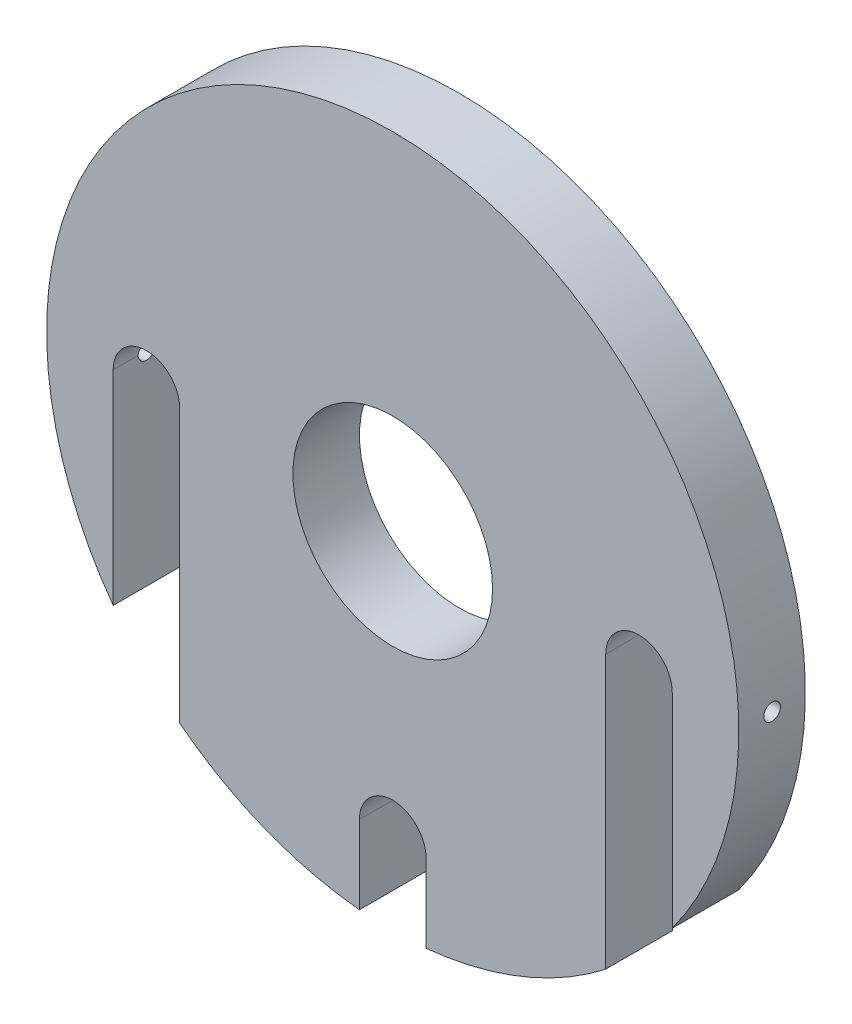
ISO-10303-21;
HEADER;
FILE_DESCRIPTION(('STEP AP214'),'2;1');
FILE_NAME('part.step','',(''),(''),'','','');
FILE_SCHEMA(('AUTOMOTIVE_DESIGN { 1 0 10303 214 1 1 1 1 }'));
ENDSEC;
DATA;
#1=APPLICATION_CONTEXT('core data for automotive mechanical design processes');
#2=APPLICATION_PROTOCOL_DEFINITION('international standard','automotive_design',2000,#1);
#3=PRODUCT_CONTEXT('',#1,'mechanical');
#4=PRODUCT('Part','Part','',(#3));
#5=PRODUCT_RELATED_PRODUCT_CATEGORY('part','',(#4));
#6=PRODUCT_DEFINITION_FORMATION('','',#4);
#7=PRODUCT_DEFINITION_CONTEXT('part definition',#1,'design');
#8=PRODUCT_DEFINITION('design','',#6,#7);
#9=PRODUCT_DEFINITION_SHAPE('','',#8);
#10=(LENGTH_UNIT() NAMED_UNIT(*) SI_UNIT(.MILLI.,.METRE.));
#11=(NAMED_UNIT(*) PLANE_ANGLE_UNIT() SI_UNIT($,.RADIAN.));
#12=(NAMED_UNIT(*) SI_UNIT($,.STERADIAN.) SOLID_ANGLE_UNIT());
#13=UNCERTAINTY_MEASURE_WITH_UNIT(LENGTH_MEASURE(1.E-05),#10,'distance_accuracy_value','');
#14=(GEOMETRIC_REPRESENTATION_CONTEXT(3) GLOBAL_UNCERTAINTY_ASSIGNED_CONTEXT((#13)) GLOBAL_UNIT_ASSIGNED_CONTEXT((#10,
#11,#12)) REPRESENTATION_CONTEXT('',''));
#15=CARTESIAN_POINT('',(0.,0.,0.));
#16=DIRECTION('',(0.,0.,1.));
#17=DIRECTION('',(1.,0.,0.));
#18=AXIS2_PLACEMENT_3D('',#15,#16,#17);
#19=CARTESIAN_POINT('',(0.,0.,10.));
#20=DIRECTION('',(0.,0.,-1.));
#21=DIRECTION('',(-1.,0.,0.));
#22=AXIS2_PLACEMENT_3D('',#19,#20,#21);
#23=CYLINDRICAL_SURFACE('',#22,52.);
#24=CARTESIAN_POINT('',(-52.,0.,6.24999999999998));
#25=CARTESIAN_POINT('',(-51.9999997973088,-0.0702021682379091,6.2499968895859));
#26=CARTESIAN_POINT('',(-51.9998563106322,-0.140454981450219,6.24406613697119));
#27=CARTESIAN_POINT('',(-51.9992977076912,-0.279025062442822,6.22048990731504));
#28=CARTESIAN_POINT('',(-51.9988822660825,-0.347339909542774,6.20283039859609));
#29=CARTESIAN_POINT('',(-51.9978268062926,-0.480006521059341,6.15630034243218));
#30=CARTESIAN_POINT('',(-51.9971868970592,-0.544360190296536,6.12743523302246));
#31=CARTESIAN_POINT('',(-51.99575470482,-0.667290330916391,6.05932103250131));
#32=CARTESIAN_POINT('',(-51.9949624592714,-0.725868217133678,6.02007449314121));
#33=CARTESIAN_POINT('',(-51.9933145118695,-0.835622281287134,5.93229518490517));
#34=CARTESIAN_POINT('',(-51.9924587919931,-0.886796344683112,5.88375977227363));
#35=CARTESIAN_POINT('',(-51.9907805017499,-0.980272477518451,5.77878464423165));
#36=CARTESIAN_POINT('',(-51.9899579326977,-1.02257419539248,5.72234461574973));
#37=CARTESIAN_POINT('',(-51.9884386379106,-1.09710658397418,5.60315653739074));
#38=CARTESIAN_POINT('',(-51.9877419250816,-1.12933622208278,5.54040784161421));
#39=CARTESIAN_POINT('',(-51.9865530394971,-1.18280274961246,5.41038828850494));
#40=CARTESIAN_POINT('',(-51.9860608660679,-1.2040396752478,5.34311744607073));
#41=CARTESIAN_POINT('',(-51.9853366659506,-1.23491404263499,5.20597695611337));
#42=CARTESIAN_POINT('',(-51.9851045888189,-1.24455373360457,5.13610781522614));
#43=CARTESIAN_POINT('',(-51.9849265963996,-1.25196691572491,4.99574265089226));
#44=CARTESIAN_POINT('',(-51.9849806801941,-1.2497404449398,4.92524662945722));
#45=CARTESIAN_POINT('',(-51.985368863679,-1.23348643261604,4.78564409487549));
#46=CARTESIAN_POINT('',(-51.9857029055237,-1.21946132894386,4.71653729770342));
#47=CARTESIAN_POINT('',(-51.9866132562613,-1.1800119384044,4.58165935292268));
#48=CARTESIAN_POINT('',(-51.9871895655884,-1.15458763111172,4.51588821129117));
#49=CARTESIAN_POINT('',(-51.9885195484886,-1.09305874317991,4.38954078401926));
#50=CARTESIAN_POINT('',(-51.9892732406284,-1.05695304442013,4.32896504308654));
#51=CARTESIAN_POINT('',(-51.990873002452,-0.97508713050876,4.21473394256006));
#52=CARTESIAN_POINT('',(-51.9917190722579,-0.929326902589633,4.16107859211825));
#53=CARTESIAN_POINT('',(-51.9934084662207,-0.829437096207218,4.06219713975511));
#54=CARTESIAN_POINT('',(-51.9942517896282,-0.77530540162422,4.01697317549234));
#55=CARTESIAN_POINT('',(-51.9958404123069,-0.660216745710646,3.93625470582223));
#56=CARTESIAN_POINT('',(-51.9965857115635,-0.599259783359249,3.90076020187007));
#57=CARTESIAN_POINT('',(-51.9978942729366,-0.472249784187237,3.84050847217416));
#58=CARTESIAN_POINT('',(-51.9984575339415,-0.406196716252543,3.81575131199297));
#59=CARTESIAN_POINT('',(-51.9993385031685,-0.270870063484839,3.77767840062746));
#60=CARTESIAN_POINT('',(-51.9996562118238,-0.201596484331865,3.76436262926472));
#61=CARTESIAN_POINT('',(-52.0000102059479,-0.0618138289347149,3.7495531009642));
#62=CARTESIAN_POINT('',(-52.000046561819,0.00869493380591818,3.74805638656743));
#63=CARTESIAN_POINT('',(-51.9998339383627,0.148962758512663,3.75691975412827));
#64=CARTESIAN_POINT('',(-51.9995849592427,0.218721821024188,3.76727982745936));
#65=CARTESIAN_POINT('',(-51.9988297750903,0.355501780963677,3.79956023565669));
#66=CARTESIAN_POINT('',(-51.9983235998992,0.422522995077548,3.82147922940406));
#67=CARTESIAN_POINT('',(-51.9971110723133,0.551934463575331,3.8762539091937));
#68=CARTESIAN_POINT('',(-51.9964047196695,0.614324712193831,3.90910960885154));
#69=CARTESIAN_POINT('',(-51.9948712563162,0.732716819717158,3.98483266008584));
#70=CARTESIAN_POINT('',(-51.9940441215981,0.788717404551271,4.02770200316391));
#71=CARTESIAN_POINT('',(-51.9923624047139,0.892727732221843,4.12223250589846));
#72=CARTESIAN_POINT('',(-51.9915078224988,0.940737460803128,4.17389368123867));
#73=CARTESIAN_POINT('',(-51.9898673530022,1.02741309597303,4.28455402755676));
#74=CARTESIAN_POINT('',(-51.9890814797713,1.06607709425557,4.34355469346742));
#75=CARTESIAN_POINT('',(-51.9876672523362,1.13295066954025,4.46721152634058));
#76=CARTESIAN_POINT('',(-51.9870388978446,1.16116026562596,4.53186768297923));
#77=CARTESIAN_POINT('',(-51.9860106523504,1.20632093427851,4.66499293625244));
#78=CARTESIAN_POINT('',(-51.9856107362014,1.22327324608078,4.73346161229381));
#79=CARTESIAN_POINT('',(-51.9850843853326,1.2454421997953,4.87227432871524));
#80=CARTESIAN_POINT('',(-51.9849579506351,1.25065884075391,4.94261836924769));
#81=CARTESIAN_POINT('',(-51.9849928270816,1.24920821155983,5.08316579760952));
#82=CARTESIAN_POINT('',(-51.9851540651841,1.24254395802412,5.1533692166126));
#83=CARTESIAN_POINT('',(-51.9857459567771,1.2175269006696,5.29166052483359));
#84=CARTESIAN_POINT('',(-51.9861766108046,1.19917407354676,5.35974840983338));
#85=CARTESIAN_POINT('',(-51.9872587776231,1.15130109720322,5.49187742806503));
#86=CARTESIAN_POINT('',(-51.9879102943159,1.12178075069791,5.55591848978267));
#87=CARTESIAN_POINT('',(-51.9893607075731,1.05241220497476,5.67813381072752));
#88=CARTESIAN_POINT('',(-51.9901595986442,1.01256439069638,5.73630828850982));
#89=CARTESIAN_POINT('',(-51.9918148783833,0.923664897688957,5.84515186657948));
#90=CARTESIAN_POINT('',(-51.9926712755141,0.874611862405308,5.8958198586795));
#91=CARTESIAN_POINT('',(-51.9943451605303,0.768681394127143,5.98821499771678));
#92=CARTESIAN_POINT('',(-51.9951626387157,0.711802024121723,6.02993992469413));
#93=CARTESIAN_POINT('',(-51.9966667561658,0.591815674581007,6.10326914926611));
#94=CARTESIAN_POINT('',(-51.9973533183665,0.528705059981918,6.13486749323264));
#95=CARTESIAN_POINT('',(-51.998516752348,0.398121934825982,6.18698344501717));
#96=CARTESIAN_POINT('',(-51.9989938745281,0.330654744203557,6.20751429148876));
#97=CARTESIAN_POINT('',(-51.9995568847217,0.218966673448215,6.23146046341417));
#98=CARTESIAN_POINT('',(-51.9997223338094,0.175471022833649,6.23840406759431));
#99=CARTESIAN_POINT('',(-51.9999439549651,0.087990214559126,6.24767481030989));
#100=CARTESIAN_POINT('',(-52.0000001270536,0.0440050569909726,6.25000194971111));
#101=CARTESIAN_POINT('',(-52.,0.,6.24999999999998));
#102=B_SPLINE_CURVE_WITH_KNOTS('',3,(#24,#25,#26,#27,#28,#29,#30,#31,#32,#33,#34,#35,#36,#37,
#38,#39,#40,#41,#42,#43,#44,#45,#46,#47,#48,#49,#50,#51,#52,#53,#54,#55,#56,#57,#58,#59,#60,#61,
#62,#63,#64,#65,#66,#67,#68,#69,#70,#71,#72,#73,#74,#75,#76,#77,#78,#79,#80,#81,#82,#83,#84,#85,
#86,#87,#88,#89,#90,#91,#92,#93,#94,#95,#96,#97,#98,#99,#100,#101),.UNSPECIFIED.,.T.,.F.,(4,2,2,
2,2,2,2,2,2,2,2,2,2,2,2,2,2,2,2,2,2,2,2,2,2,2,2,2,2,2,2,2,2,2,2,2,2,2,4),(0.,0.210445882634705,
0.421143986444405,0.631739966835604,0.842284230842992,1.052888508329,1.2635011294014,
1.47413533559935,1.68476884788204,1.89536150240385,2.1059534813895,2.31650195795665,
2.52705081179168,2.73762171353813,2.94819289375379,3.15881738892334,3.36944191559497,
3.58006772832851,3.79069316959421,4.00126590480604,4.2118384868137,4.42238664260014,
4.63293506050825,4.84352538774352,5.05411609065432,5.26474975785616,5.4753830405633,
5.68599313228496,5.89660324112071,6.10715988263968,6.31771694395633,6.52827772513291,
6.73883065912926,6.94941464628273,7.16005084685117,7.37081065858985,7.58131780231657,
7.71323231476071,7.84514680246531),.UNSPECIFIED.);
#103=CARTESIAN_POINT('',(-52.,0.,6.24999999999998));
#104=VERTEX_POINT('',#103);
#105=EDGE_CURVE('E149',#104,#104,#102,.T.);
#106=ORIENTED_EDGE('',*,*,#105,.T.);
#107=EDGE_LOOP('',(#106));
#108=FACE_BOUND('',#107,.T.);
#109=CARTESIAN_POINT('',(52.,0.,3.75));
#110=CARTESIAN_POINT('',(51.9999997973088,-0.0702021682379091,3.75000311041408));
#111=CARTESIAN_POINT('',(51.9998563106322,-0.140454981450219,3.75593386302879));
#112=CARTESIAN_POINT('',(51.9992977076912,-0.279025062442822,3.77951009268494));
#113=CARTESIAN_POINT('',(51.9988822660825,-0.347339909542774,3.79716960140389));
#114=CARTESIAN_POINT('',(51.9978268062926,-0.480006521059341,3.8436996575678));
#115=CARTESIAN_POINT('',(51.9971868970592,-0.544360190296535,3.87256476697752));
#116=CARTESIAN_POINT('',(51.99575470482,-0.66729033091639,3.94067896749867));
#117=CARTESIAN_POINT('',(51.9949624592714,-0.725868217133678,3.97992550685877));
#118=CARTESIAN_POINT('',(51.9933145118695,-0.835622281287134,4.06770481509481));
#119=CARTESIAN_POINT('',(51.9924587919931,-0.886796344683112,4.11624022772634));
#120=CARTESIAN_POINT('',(51.9907805017499,-0.980272477518451,4.22121535576833));
#121=CARTESIAN_POINT('',(51.9899579326977,-1.02257419539248,4.27765538425025));
#122=CARTESIAN_POINT('',(51.9884386379106,-1.09710658397418,4.39684346260924));
#123=CARTESIAN_POINT('',(51.9877419250816,-1.12933622208278,4.45959215838577));
#124=CARTESIAN_POINT('',(51.9865530394971,-1.18280274961246,4.58961171149504));
#125=CARTESIAN_POINT('',(51.9860608660679,-1.2040396752478,4.65688255392925));
#126=CARTESIAN_POINT('',(51.9853366659506,-1.23491404263499,4.79402304388661));
#127=CARTESIAN_POINT('',(51.9851045888189,-1.24455373360457,4.86389218477383));
#128=CARTESIAN_POINT('',(51.9849265963996,-1.25196691572491,5.00425734910772));
#129=CARTESIAN_POINT('',(51.9849806801941,-1.2497404449398,5.07475337054276));
#130=CARTESIAN_POINT('',(51.985368863679,-1.23348643261604,5.21435590512448));
#131=CARTESIAN_POINT('',(51.9857029055237,-1.21946132894386,5.28346270229655));
#132=CARTESIAN_POINT('',(51.9866132562613,-1.1800119384044,5.41834064707729));
#133=CARTESIAN_POINT('',(51.9871895655884,-1.15458763111172,5.48411178870881));
#134=CARTESIAN_POINT('',(51.9885195484886,-1.09305874317991,5.61045921598072));
#135=CARTESIAN_POINT('',(51.9892732406284,-1.05695304442013,5.67103495691344));
#136=CARTESIAN_POINT('',(51.990873002452,-0.97508713050876,5.78526605743992));
#137=CARTESIAN_POINT('',(51.9917190722579,-0.929326902589633,5.83892140788173));
#138=CARTESIAN_POINT('',(51.9934084662207,-0.829437096207218,5.93780286024487));
#139=CARTESIAN_POINT('',(51.9942517896282,-0.775305401624221,5.98302682450764));
#140=CARTESIAN_POINT('',(51.9958404123069,-0.660216745710647,6.06374529417775));
#141=CARTESIAN_POINT('',(51.9965857115635,-0.59925978335925,6.09923979812991));
#142=CARTESIAN_POINT('',(51.9978942729366,-0.472249784187238,6.15949152782582));
#143=CARTESIAN_POINT('',(51.9984575339415,-0.406196716252543,6.18424868800701));
#144=CARTESIAN_POINT('',(51.9993385031685,-0.27087006348484,6.22232159937251));
#145=CARTESIAN_POINT('',(51.9996562118238,-0.201596484331865,6.23563737073526));
#146=CARTESIAN_POINT('',(52.0000102059479,-0.0618138289347151,6.25044689903578));
#147=CARTESIAN_POINT('',(52.000046561819,0.00869493380591806,6.25194361343255));
#148=CARTESIAN_POINT('',(51.9998339383627,0.148962758512663,6.24308024587171));
#149=CARTESIAN_POINT('',(51.9995849592427,0.218721821024188,6.23272017254062));
#150=CARTESIAN_POINT('',(51.9988297750903,0.355501780963677,6.20043976434329));
#151=CARTESIAN_POINT('',(51.9983235998992,0.422522995077549,6.17852077059591));
#152=CARTESIAN_POINT('',(51.9971110723133,0.551934463575331,6.12374609080628));
#153=CARTESIAN_POINT('',(51.9964047196695,0.614324712193831,6.09089039114844));
#154=CARTESIAN_POINT('',(51.9948712563162,0.732716819717158,6.01516733991414));
#155=CARTESIAN_POINT('',(51.9940441215981,0.788717404551271,5.97229799683607));
#156=CARTESIAN_POINT('',(51.9923624047139,0.892727732221843,5.87776749410152));
#157=CARTESIAN_POINT('',(51.9915078224988,0.940737460803128,5.82610631876131));
#158=CARTESIAN_POINT('',(51.9898673530022,1.02741309597303,5.71544597244322));
#159=CARTESIAN_POINT('',(51.9890814797713,1.06607709425557,5.65644530653256));
#160=CARTESIAN_POINT('',(51.9876672523362,1.13295066954025,5.5327884736594));
#161=CARTESIAN_POINT('',(51.9870388978446,1.16116026562596,5.46813231702075));
#162=CARTESIAN_POINT('',(51.9860106523504,1.20632093427851,5.33500706374754));
#163=CARTESIAN_POINT('',(51.9856107362014,1.22327324608078,5.26653838770617));
#164=CARTESIAN_POINT('',(51.9850843853326,1.2454421997953,5.12772567128474));
#165=CARTESIAN_POINT('',(51.9849579506351,1.25065884075391,5.05738163075229));
#166=CARTESIAN_POINT('',(51.9849928270816,1.24920821155983,4.91683420239045));
#167=CARTESIAN_POINT('',(51.9851540651841,1.24254395802412,4.84663078338738));
#168=CARTESIAN_POINT('',(51.9857459567771,1.2175269006696,4.70833947516639));
#169=CARTESIAN_POINT('',(51.9861766108046,1.19917407354676,4.6402515901666));
#170=CARTESIAN_POINT('',(51.9872587776231,1.15130109720322,4.50812257193495));
#171=CARTESIAN_POINT('',(51.9879102943159,1.12178075069791,4.44408151021731));
#172=CARTESIAN_POINT('',(51.9893607075731,1.05241220497476,4.32186618927245));
#173=CARTESIAN_POINT('',(51.9901595986442,1.01256439069638,4.26369171149015));
#174=CARTESIAN_POINT('',(51.9918148783833,0.923664897688957,4.15484813342049));
#175=CARTESIAN_POINT('',(51.9926712755141,0.874611862405308,4.10418014132048));
#176=CARTESIAN_POINT('',(51.9943451605303,0.768681394127143,4.01178500228319));
#177=CARTESIAN_POINT('',(51.9951626387157,0.711802024121723,3.97006007530585));
#178=CARTESIAN_POINT('',(51.9966667561658,0.591815674581007,3.89673085073387));
#179=CARTESIAN_POINT('',(51.9973533183665,0.528705059981918,3.86513250676734));
#180=CARTESIAN_POINT('',(51.998516752348,0.398121934825982,3.81301655498281));
#181=CARTESIAN_POINT('',(51.9989938745281,0.330654744203557,3.79248570851122));
#182=CARTESIAN_POINT('',(51.9995568847217,0.218966673448215,3.76853953658581));
#183=CARTESIAN_POINT('',(51.9997223338094,0.175471022833649,3.76159593240567));
#184=CARTESIAN_POINT('',(51.9999439549651,0.087990214559126,3.75232518969009));
#185=CARTESIAN_POINT('',(52.0000001270536,0.0440050569909727,3.74999805028887));
#186=CARTESIAN_POINT('',(52.,0.,3.75));
#187=B_SPLINE_CURVE_WITH_KNOTS('',3,(#109,#110,#111,#112,#113,#114,#115,#116,#117,#118,#119,
#120,#121,#122,#123,#124,#125,#126,#127,#128,#129,#130,#131,#132,#133,#134,#135,#136,#137,#138,
#139,#140,#141,#142,#143,#144,#145,#146,#147,#148,#149,#150,#151,#152,#153,#154,#155,#156,#157,
#158,#159,#160,#161,#162,#163,#164,#165,#166,#167,#168,#169,#170,#171,#172,#173,#174,#175,#176,
#177,#178,#179,#180,#181,#182,#183,#184,#185,#186),.UNSPECIFIED.,.T.,.F.,(4,2,2,2,2,2,2,2,2,2,2,
2,2,2,2,2,2,2,2,2,2,2,2,2,2,2,2,2,2,2,2,2,2,2,2,2,2,2,4),(0.,0.210445882634705,
0.421143986444404,0.631739966835603,0.842284230842992,1.052888508329,1.2635011294014,
1.47413533559935,1.68476884788204,1.89536150240385,2.1059534813895,2.31650195795665,
2.52705081179168,2.73762171353813,2.94819289375379,3.15881738892333,3.36944191559497,
3.58006772832851,3.79069316959421,4.00126590480604,4.2118384868137,4.42238664260014,
4.63293506050825,4.84352538774352,5.05411609065432,5.26474975785616,5.4753830405633,
5.68599313228496,5.89660324112071,6.10715988263968,6.31771694395633,6.52827772513291,
6.73883065912926,6.94941464628273,7.16005084685117,7.37081065858985,7.58131780231657,
7.71323231476071,7.84514680246531),.UNSPECIFIED.);
#188=CARTESIAN_POINT('',(52.,0.,3.75));
#189=VERTEX_POINT('',#188);
#190=EDGE_CURVE('E242',#189,#189,#187,.T.);
#191=ORIENTED_EDGE('',*,*,#190,.T.);
#192=EDGE_LOOP('',(#191));
#193=FACE_BOUND('',#192,.T.);
#194=CARTESIAN_POINT('',(0.,0.,10.));
#195=DIRECTION('',(0.,0.,1.));
#196=DIRECTION('',(1.,0.,0.));
#197=AXIS2_PLACEMENT_3D('',#194,#195,#196);
#198=CIRCLE('',#197,52.);
#199=CARTESIAN_POINT('',(42.,-30.6594194335118,10.));
#200=VERTEX_POINT('',#199);
#201=CARTESIAN_POINT('',(-42.,-30.6594194335118,10.));
#202=VERTEX_POINT('',#201);
#203=EDGE_CURVE('E204',#200,#202,#198,.T.);
#204=ORIENTED_EDGE('',*,*,#203,.F.);
#205=DIRECTION('',(0.,0.,-1.));
#206=VECTOR('',#205,1.);
#207=CARTESIAN_POINT('',(42.,-30.6594194335118,10.));
#208=LINE('',#207,#206);
#209=CARTESIAN_POINT('',(42.,-30.6594194335118,0.));
#210=VERTEX_POINT('',#209);
#211=EDGE_CURVE('E200',#200,#210,#208,.T.);
#212=ORIENTED_EDGE('',*,*,#211,.T.);
#213=CARTESIAN_POINT('',(0.,0.,0.));
#214=DIRECTION('',(0.,0.,1.));
#215=DIRECTION('',(1.,0.,0.));
#216=AXIS2_PLACEMENT_3D('',#213,#214,#215);
#217=CIRCLE('',#216,52.);
#218=CARTESIAN_POINT('',(-42.,-30.6594194335118,0.));
#219=VERTEX_POINT('',#218);
#220=EDGE_CURVE('E203',#210,#219,#217,.T.);
#221=ORIENTED_EDGE('',*,*,#220,.T.);
#222=DIRECTION('',(0.,0.,-1.));
#223=VECTOR('',#222,1.);
#224=CARTESIAN_POINT('',(-42.,-30.6594194335118,10.));
#225=LINE('',#224,#223);
#226=EDGE_CURVE('E191',#219,#202,#225,.F.);
#227=ORIENTED_EDGE('',*,*,#226,.T.);
#228=EDGE_LOOP('',(#204,#212,#221,#227));
#229=FACE_BOUND('',#228,.T.);
#230=ADVANCED_FACE('F37',(#108,#193,#229),#23,.T.);
#231=CARTESIAN_POINT('',(-32.,-40.9878030638384,10.));
#232=VERTEX_POINT('',#231);
#233=CARTESIAN_POINT('',(-5.,-51.7590571784301,10.));
#234=VERTEX_POINT('',#233);
#235=EDGE_CURVE('E209',#232,#234,#198,.T.);
#236=ORIENTED_EDGE('',*,*,#235,.F.);
#237=DIRECTION('',(0.,0.,-1.));
#238=VECTOR('',#237,1.);
#239=CARTESIAN_POINT('',(-32.,-40.9878030638384,10.));
#240=LINE('',#239,#238);
#241=CARTESIAN_POINT('',(-32.,-40.9878030638384,0.));
#242=VERTEX_POINT('',#241);
#243=EDGE_CURVE('E194',#232,#242,#240,.T.);
#244=ORIENTED_EDGE('',*,*,#243,.T.);
#245=CARTESIAN_POINT('',(-5.,-51.7590571784301,0.));
#246=VERTEX_POINT('',#245);
#247=EDGE_CURVE('E208',#242,#246,#217,.T.);
#248=ORIENTED_EDGE('',*,*,#247,.T.);
#249=DIRECTION('',(0.,0.,-1.));
#250=VECTOR('',#249,1.);
#251=CARTESIAN_POINT('',(-5.,-51.7590571784301,10.));
#252=LINE('',#251,#250);
#253=EDGE_CURVE('E184',#246,#234,#252,.F.);
#254=ORIENTED_EDGE('',*,*,#253,.T.);
#255=EDGE_LOOP('',(#236,#244,#248,#254));
#256=FACE_BOUND('',#255,.T.);
#257=ADVANCED_FACE('F236',(#256),#23,.T.);
#258=CARTESIAN_POINT('',(5.,-51.7590571784301,0.));
#259=VERTEX_POINT('',#258);
#260=CARTESIAN_POINT('',(32.,-40.9878030638384,0.));
#261=VERTEX_POINT('',#260);
#262=EDGE_CURVE('E212',#259,#261,#217,.T.);
#263=ORIENTED_EDGE('',*,*,#262,.T.);
#264=DIRECTION('',(0.,0.,-1.));
#265=VECTOR('',#264,1.);
#266=CARTESIAN_POINT('',(32.,-40.9878030638384,10.));
#267=LINE('',#266,#265);
#268=CARTESIAN_POINT('',(32.,-40.9878030638384,10.));
#269=VERTEX_POINT('',#268);
#270=EDGE_CURVE('E197',#261,#269,#267,.F.);
#271=ORIENTED_EDGE('',*,*,#270,.T.);
#272=CARTESIAN_POINT('',(5.,-51.7590571784301,10.));
#273=VERTEX_POINT('',#272);
#274=EDGE_CURVE('E207',#273,#269,#198,.T.);
#275=ORIENTED_EDGE('',*,*,#274,.F.);
#276=DIRECTION('',(0.,0.,-1.));
#277=VECTOR('',#276,1.);
#278=CARTESIAN_POINT('',(5.,-51.7590571784301,10.));
#279=LINE('',#278,#277);
#280=EDGE_CURVE('E187',#273,#259,#279,.T.);
#281=ORIENTED_EDGE('',*,*,#280,.T.);
#282=EDGE_LOOP('',(#263,#271,#275,#281));
#283=FACE_BOUND('',#282,.T.);
#284=ADVANCED_FACE('F231',(#283),#23,.T.);
#285=CARTESIAN_POINT('',(0.,0.,10.));
#286=DIRECTION('',(0.,0.,1.));
#287=DIRECTION('',(1.,0.,0.));
#288=AXIS2_PLACEMENT_3D('',#285,#286,#287);
#289=PLANE('',#288);
#290=CARTESIAN_POINT('',(0.,0.,10.));
#291=DIRECTION('',(0.,0.,1.));
#292=DIRECTION('',(1.,0.,0.));
#293=AXIS2_PLACEMENT_3D('',#290,#291,#292);
#294=CIRCLE('',#293,15.);
#295=CARTESIAN_POINT('',(15.,0.,10.));
#296=VERTEX_POINT('',#295);
#297=EDGE_CURVE('E338',#296,#296,#294,.T.);
#298=ORIENTED_EDGE('',*,*,#297,.F.);
#299=EDGE_LOOP('',(#298));
#300=FACE_BOUND('',#299,.T.);
#301=DIRECTION('',(0.,1.,0.));
#302=VECTOR('',#301,1.);
#303=CARTESIAN_POINT('',(42.,3.54103707564824E-07,10.));
#304=LINE('',#303,#302);
#305=CARTESIAN_POINT('',(42.,3.54103706807145E-07,10.));
#306=VERTEX_POINT('',#305);
#307=EDGE_CURVE('E294',#200,#306,#304,.T.);
#308=ORIENTED_EDGE('',*,*,#307,.F.);
#309=ORIENTED_EDGE('',*,*,#203,.T.);
#310=DIRECTION('',(0.,-1.,0.));
#311=VECTOR('',#310,1.);
#312=CARTESIAN_POINT('',(-42.,3.54103707564824E-07,10.));
#313=LINE('',#312,#311);
#314=CARTESIAN_POINT('',(-42.,3.54103707564824E-07,10.));
#315=VERTEX_POINT('',#314);
#316=EDGE_CURVE('E291',#315,#202,#313,.T.);
#317=ORIENTED_EDGE('',*,*,#316,.F.);
#318=CARTESIAN_POINT('',(-37.,0.,10.));
#319=DIRECTION('',(0.,0.,1.));
#320=DIRECTION('',(1.,0.,0.));
#321=AXIS2_PLACEMENT_3D('',#318,#319,#320);
#322=CIRCLE('',#321,5.00000000000001);
#323=CARTESIAN_POINT('',(-32.,0.,10.));
#324=VERTEX_POINT('',#323);
#325=EDGE_CURVE('E154',#324,#315,#322,.T.);
#326=ORIENTED_EDGE('',*,*,#325,.F.);
#327=DIRECTION('',(0.,1.,0.));
#328=VECTOR('',#327,1.);
#329=CARTESIAN_POINT('',(-32.,0.,10.));
#330=LINE('',#329,#328);
#331=EDGE_CURVE('E314',#232,#324,#330,.T.);
#332=ORIENTED_EDGE('',*,*,#331,.F.);
#333=ORIENTED_EDGE('',*,*,#235,.T.);
#334=DIRECTION('',(0.,-1.,0.));
#335=VECTOR('',#334,1.);
#336=CARTESIAN_POINT('',(-5.,-39.9999996458963,10.));
#337=LINE('',#336,#335);
#338=CARTESIAN_POINT('',(-5.,-39.9999996458963,10.));
#339=VERTEX_POINT('',#338);
#340=EDGE_CURVE('E169',#339,#234,#337,.T.);
#341=ORIENTED_EDGE('',*,*,#340,.F.);
#342=CARTESIAN_POINT('',(0.,-40.,10.));
#343=DIRECTION('',(0.,0.,1.));
#344=DIRECTION('',(1.,0.,0.));
#345=AXIS2_PLACEMENT_3D('',#342,#343,#344);
#346=CIRCLE('',#345,5.00000000000001);
#347=CARTESIAN_POINT('',(5.00000000000001,-40.,10.));
#348=VERTEX_POINT('',#347);
#349=EDGE_CURVE('E175',#348,#339,#346,.T.);
#350=ORIENTED_EDGE('',*,*,#349,.F.);
#351=DIRECTION('',(0.,1.,0.));
#352=VECTOR('',#351,1.);
#353=CARTESIAN_POINT('',(5.00000000000001,-40.,10.));
#354=LINE('',#353,#352);
#355=EDGE_CURVE('E173',#273,#348,#354,.T.);
#356=ORIENTED_EDGE('',*,*,#355,.F.);
#357=ORIENTED_EDGE('',*,*,#274,.T.);
#358=DIRECTION('',(0.,-1.,0.));
#359=VECTOR('',#358,1.);
#360=CARTESIAN_POINT('',(32.,0.,10.));
#361=LINE('',#360,#359);
#362=CARTESIAN_POINT('',(32.,0.,10.));
#363=VERTEX_POINT('',#362);
#364=EDGE_CURVE('E300',#363,#269,#361,.T.);
#365=ORIENTED_EDGE('',*,*,#364,.F.);
#366=CARTESIAN_POINT('',(37.,0.,10.));
#367=DIRECTION('',(0.,0.,1.));
#368=DIRECTION('',(-1.,0.,0.));
#369=AXIS2_PLACEMENT_3D('',#366,#367,#368);
#370=CIRCLE('',#369,5.00000000000001);
#371=EDGE_CURVE('E297',#306,#363,#370,.T.);
#372=ORIENTED_EDGE('',*,*,#371,.F.);
#373=EDGE_LOOP('',(#308,#309,#317,#326,#332,#333,#341,#350,#356,#357,#365,#372));
#374=FACE_BOUND('',#373,.T.);
#375=ADVANCED_FACE('F235',(#300,#374),#289,.T.);
#376=CARTESIAN_POINT('',(0.,0.,0.));
#377=DIRECTION('',(0.,0.,1.));
#378=DIRECTION('',(1.,0.,0.));
#379=AXIS2_PLACEMENT_3D('',#376,#377,#378);
#380=PLANE('',#379);
#381=CARTESIAN_POINT('',(0.,0.,0.));
#382=DIRECTION('',(0.,0.,1.));
#383=DIRECTION('',(1.,0.,0.));
#384=AXIS2_PLACEMENT_3D('',#381,#382,#383);
#385=CIRCLE('',#384,15.);
#386=CARTESIAN_POINT('',(15.,0.,0.));
#387=VERTEX_POINT('',#386);
#388=EDGE_CURVE('E176',#387,#387,#385,.T.);
#389=ORIENTED_EDGE('',*,*,#388,.T.);
#390=EDGE_LOOP('',(#389));
#391=FACE_BOUND('',#390,.T.);
#392=ORIENTED_EDGE('',*,*,#220,.F.);
#393=DIRECTION('',(0.,1.,0.));
#394=VECTOR('',#393,1.);
#395=CARTESIAN_POINT('',(42.,0.,0.));
#396=LINE('',#395,#394);
#397=CARTESIAN_POINT('',(42.,3.54103706807145E-07,0.));
#398=VERTEX_POINT('',#397);
#399=EDGE_CURVE('E219',#210,#398,#396,.T.);
#400=ORIENTED_EDGE('',*,*,#399,.T.);
#401=CARTESIAN_POINT('',(37.,0.,0.));
#402=DIRECTION('',(0.,0.,1.));
#403=DIRECTION('',(-1.,0.,0.));
#404=AXIS2_PLACEMENT_3D('',#401,#402,#403);
#405=CIRCLE('',#404,5.00000000000001);
#406=CARTESIAN_POINT('',(32.,0.,0.));
#407=VERTEX_POINT('',#406);
#408=EDGE_CURVE('E307',#398,#407,#405,.T.);
#409=ORIENTED_EDGE('',*,*,#408,.T.);
#410=DIRECTION('',(0.,-1.,0.));
#411=VECTOR('',#410,1.);
#412=CARTESIAN_POINT('',(32.,0.,0.));
#413=LINE('',#412,#411);
#414=EDGE_CURVE('E303',#407,#261,#413,.T.);
#415=ORIENTED_EDGE('',*,*,#414,.T.);
#416=ORIENTED_EDGE('',*,*,#262,.F.);
#417=DIRECTION('',(0.,1.,0.));
#418=VECTOR('',#417,1.);
#419=CARTESIAN_POINT('',(5.00000000000005,0.,0.));
#420=LINE('',#419,#418);
#421=CARTESIAN_POINT('',(5.00000000000001,-40.,0.));
#422=VERTEX_POINT('',#421);
#423=EDGE_CURVE('E213',#259,#422,#420,.T.);
#424=ORIENTED_EDGE('',*,*,#423,.T.);
#425=CARTESIAN_POINT('',(0.,-40.,0.));
#426=DIRECTION('',(0.,0.,1.));
#427=DIRECTION('',(1.,0.,0.));
#428=AXIS2_PLACEMENT_3D('',#425,#426,#427);
#429=CIRCLE('',#428,5.00000000000001);
#430=CARTESIAN_POINT('',(-5.,-39.9999996458963,0.));
#431=VERTEX_POINT('',#430);
#432=EDGE_CURVE('E165',#422,#431,#429,.T.);
#433=ORIENTED_EDGE('',*,*,#432,.T.);
#434=DIRECTION('',(0.,-1.,0.));
#435=VECTOR('',#434,1.);
#436=CARTESIAN_POINT('',(-5.,-39.9999996458963,0.));
#437=LINE('',#436,#435);
#438=EDGE_CURVE('E168',#431,#246,#437,.T.);
#439=ORIENTED_EDGE('',*,*,#438,.T.);
#440=ORIENTED_EDGE('',*,*,#247,.F.);
#441=DIRECTION('',(0.,1.,0.));
#442=VECTOR('',#441,1.);
#443=CARTESIAN_POINT('',(-32.,0.,0.));
#444=LINE('',#443,#442);
#445=CARTESIAN_POINT('',(-32.,0.,0.));
#446=VERTEX_POINT('',#445);
#447=EDGE_CURVE('E216',#242,#446,#444,.T.);
#448=ORIENTED_EDGE('',*,*,#447,.T.);
#449=CARTESIAN_POINT('',(-37.,0.,0.));
#450=DIRECTION('',(0.,0.,1.));
#451=DIRECTION('',(1.,0.,0.));
#452=AXIS2_PLACEMENT_3D('',#449,#450,#451);
#453=CIRCLE('',#452,5.00000000000001);
#454=CARTESIAN_POINT('',(-42.,3.54103707564824E-07,0.));
#455=VERTEX_POINT('',#454);
#456=EDGE_CURVE('E160',#446,#455,#453,.T.);
#457=ORIENTED_EDGE('',*,*,#456,.T.);
#458=DIRECTION('',(0.,-1.,0.));
#459=VECTOR('',#458,1.);
#460=CARTESIAN_POINT('',(-42.,3.54103707564824E-07,0.));
#461=LINE('',#460,#459);
#462=EDGE_CURVE('E156',#455,#219,#461,.T.);
#463=ORIENTED_EDGE('',*,*,#462,.T.);
#464=EDGE_LOOP('',(#392,#400,#409,#415,#416,#424,#433,#439,#440,#448,#457,#463));
#465=FACE_BOUND('',#464,.T.);
#466=ADVANCED_FACE('F238',(#391,#465),#380,.F.);
#467=CARTESIAN_POINT('',(5.00000000000001,-40.,0.));
#468=DIRECTION('',(1.,0.,0.));
#469=DIRECTION('',(0.,1.,0.));
#470=AXIS2_PLACEMENT_3D('',#467,#468,#469);
#471=PLANE('',#470);
#472=ORIENTED_EDGE('',*,*,#355,.T.);
#473=DIRECTION('',(0.,0.,1.));
#474=VECTOR('',#473,1.);
#475=CARTESIAN_POINT('',(5.00000000000001,-40.,0.));
#476=LINE('',#475,#474);
#477=EDGE_CURVE('E172',#422,#348,#476,.T.);
#478=ORIENTED_EDGE('',*,*,#477,.F.);
#479=ORIENTED_EDGE('',*,*,#423,.F.);
#480=ORIENTED_EDGE('',*,*,#280,.F.);
#481=EDGE_LOOP('',(#472,#478,#479,#480));
#482=FACE_BOUND('',#481,.T.);
#483=ADVANCED_FACE('F350',(#482),#471,.F.);
#484=CARTESIAN_POINT('',(-5.,-39.9999996458963,0.));
#485=DIRECTION('',(-1.,0.,0.));
#486=DIRECTION('',(0.,0.,1.));
#487=AXIS2_PLACEMENT_3D('',#484,#485,#486);
#488=PLANE('',#487);
#489=ORIENTED_EDGE('',*,*,#438,.F.);
#490=DIRECTION('',(0.,0.,1.));
#491=VECTOR('',#490,1.);
#492=CARTESIAN_POINT('',(-5.,-39.9999996458963,0.));
#493=LINE('',#492,#491);
#494=EDGE_CURVE('E180',#431,#339,#493,.T.);
#495=ORIENTED_EDGE('',*,*,#494,.T.);
#496=ORIENTED_EDGE('',*,*,#340,.T.);
#497=ORIENTED_EDGE('',*,*,#253,.F.);
#498=EDGE_LOOP('',(#489,#495,#496,#497));
#499=FACE_BOUND('',#498,.T.);
#500=ADVANCED_FACE('F354',(#499),#488,.F.);
#501=CARTESIAN_POINT('',(0.,-40.,0.));
#502=DIRECTION('',(0.,0.,1.));
#503=DIRECTION('',(1.,0.,0.));
#504=AXIS2_PLACEMENT_3D('',#501,#502,#503);
#505=CYLINDRICAL_SURFACE('',#504,5.00000000000001);
#506=ORIENTED_EDGE('',*,*,#349,.T.);
#507=ORIENTED_EDGE('',*,*,#494,.F.);
#508=ORIENTED_EDGE('',*,*,#432,.F.);
#509=ORIENTED_EDGE('',*,*,#477,.T.);
#510=EDGE_LOOP('',(#506,#507,#508,#509));
#511=FACE_BOUND('',#510,.T.);
#512=ADVANCED_FACE('F356',(#511),#505,.F.);
#513=CARTESIAN_POINT('',(-32.,0.,0.));
#514=DIRECTION('',(1.,0.,0.));
#515=DIRECTION('',(0.,1.,0.));
#516=AXIS2_PLACEMENT_3D('',#513,#514,#515);
#517=PLANE('',#516);
#518=ORIENTED_EDGE('',*,*,#331,.T.);
#519=DIRECTION('',(0.,0.,1.));
#520=VECTOR('',#519,1.);
#521=CARTESIAN_POINT('',(-32.,0.,0.));
#522=LINE('',#521,#520);
#523=EDGE_CURVE('E158',#446,#324,#522,.T.);
#524=ORIENTED_EDGE('',*,*,#523,.F.);
#525=ORIENTED_EDGE('',*,*,#447,.F.);
#526=ORIENTED_EDGE('',*,*,#243,.F.);
#527=EDGE_LOOP('',(#518,#524,#525,#526));
#528=FACE_BOUND('',#527,.T.);
#529=ADVANCED_FACE('F319',(#528),#517,.F.);
#530=CARTESIAN_POINT('',(-42.,3.54103707564824E-07,0.));
#531=DIRECTION('',(-1.,0.,0.));
#532=DIRECTION('',(0.,-1.,0.));
#533=AXIS2_PLACEMENT_3D('',#530,#531,#532);
#534=PLANE('',#533);
#535=DIRECTION('',(0.,0.,1.));
#536=VECTOR('',#535,1.);
#537=CARTESIAN_POINT('',(-42.,3.54103707564824E-07,0.));
#538=LINE('',#537,#536);
#539=CARTESIAN_POINT('',(-42.,3.54103707564824E-07,3.75000000000004));
#540=VERTEX_POINT('',#539);
#541=EDGE_CURVE('E148',#455,#540,#538,.T.);
#542=ORIENTED_EDGE('',*,*,#541,.T.);
#543=CARTESIAN_POINT('',(-42.,1.02198095733564E-08,4.99999999999999));
#544=DIRECTION('',(-1.,0.,0.));
#545=DIRECTION('',(0.,-1.,0.));
#546=AXIS2_PLACEMENT_3D('',#543,#544,#545);
#547=CIRCLE('',#546,1.24999999999999);
#548=CARTESIAN_POINT('',(-42.,1.02198095733564E-08,6.24999999999998));
#549=VERTEX_POINT('',#548);
#550=EDGE_CURVE('E55',#540,#549,#547,.T.);
#551=ORIENTED_EDGE('',*,*,#550,.T.);
#552=EDGE_CURVE('E145',#549,#315,#538,.T.);
#553=ORIENTED_EDGE('',*,*,#552,.T.);
#554=ORIENTED_EDGE('',*,*,#316,.T.);
#555=ORIENTED_EDGE('',*,*,#226,.F.);
#556=ORIENTED_EDGE('',*,*,#462,.F.);
#557=EDGE_LOOP('',(#542,#551,#553,#554,#555,#556));
#558=FACE_BOUND('',#557,.T.);
#559=ADVANCED_FACE('F144',(#558),#534,.F.);
#560=CARTESIAN_POINT('',(-37.,0.,0.));
#561=DIRECTION('',(0.,0.,1.));
#562=DIRECTION('',(1.,0.,0.));
#563=AXIS2_PLACEMENT_3D('',#560,#561,#562);
#564=CYLINDRICAL_SURFACE('',#563,5.00000000000001);
#565=ORIENTED_EDGE('',*,*,#552,.F.);
#566=CARTESIAN_POINT('',(-42.,3.54103706807145E-07,6.24999999999993));
#567=CARTESIAN_POINT('',(-42.0000019698079,0.0345962109782526,6.25000036644965));
#568=CARTESIAN_POINT('',(-41.999640493621,0.0691749906302355,6.24856281453843));
#569=CARTESIAN_POINT('',(-41.9982116469048,0.138075044568687,6.24283186136608));
#570=CARTESIAN_POINT('',(-41.9971443861605,0.172396358064521,6.2385389042637));
#571=CARTESIAN_POINT('',(-41.9929230926927,0.274465490095277,6.22143803266554));
#572=CARTESIAN_POINT('',(-41.9887493158735,0.341513596232846,6.20440785583315));
#573=CARTESIAN_POINT('',(-41.9781308875827,0.471689335969868,6.15963550749786));
#574=CARTESIAN_POINT('',(-41.9716863215422,0.53481711695396,6.13189373898063));
#575=CARTESIAN_POINT('',(-41.9572127083487,0.655545884497706,6.06652295796593));
#576=CARTESIAN_POINT('',(-41.9491832934728,0.71314558379131,6.02889165018515));
#577=CARTESIAN_POINT('',(-41.9322287290939,0.822334029249158,5.94400065219769));
#578=CARTESIAN_POINT('',(-41.9232898465827,0.873793079816829,5.89657695299726));
#579=CARTESIAN_POINT('',(-41.9056141001334,0.968120926979007,5.79379367709673));
#580=CARTESIAN_POINT('',(-41.89687727428,1.01098811561551,5.73843261824726));
#581=CARTESIAN_POINT('',(-41.880456208843,1.08752336887309,5.62033545394083));
#582=CARTESIAN_POINT('',(-41.8727895195481,1.12104543146148,5.55750206921887));
#583=CARTESIAN_POINT('',(-41.8595788034778,1.17699870073981,5.42687248415289));
#584=CARTESIAN_POINT('',(-41.854034328476,1.19943224969228,5.35907733537491));
#585=CARTESIAN_POINT('',(-41.8458373330429,1.23212892615481,5.22188082825314));
#586=CARTESIAN_POINT('',(-41.8431291390805,1.24262670917993,5.15253879665146));
#587=CARTESIAN_POINT('',(-41.8407446774407,1.2518848522259,5.01302742101023));
#588=CARTESIAN_POINT('',(-41.8410679849135,1.25064685695674,4.9428581942745));
#589=CARTESIAN_POINT('',(-41.8446600652602,1.23665536261765,4.80548616944144));
#590=CARTESIAN_POINT('',(-41.8478572369156,1.22418177825743,4.73825269691737));
#591=CARTESIAN_POINT('',(-41.8567226560574,1.18851984215605,4.60686487881836));
#592=CARTESIAN_POINT('',(-41.8623910574518,1.16533082305401,4.54271072529921));
#593=CARTESIAN_POINT('',(-41.8756260626769,1.10865742748457,4.41855060853457));
#594=CARTESIAN_POINT('',(-41.8832112794338,1.07507132700606,4.35859314533797));
#595=CARTESIAN_POINT('',(-41.8994145015851,0.998628948008424,4.24506618898067));
#596=CARTESIAN_POINT('',(-41.908032663381,0.955771264856995,4.19149766564546));
#597=CARTESIAN_POINT('',(-41.9256313732954,0.860558326481679,4.09066921233942));
#598=CARTESIAN_POINT('',(-41.9346152608458,0.807967836714116,4.04363174638035));
#599=CARTESIAN_POINT('',(-41.9517145656479,0.69552228924927,3.95899059725206));
#600=CARTESIAN_POINT('',(-41.9598297591918,0.635665368715757,3.92138934077771));
#601=CARTESIAN_POINT('',(-41.9743191498168,0.510059515287858,3.85660376591814));
#602=CARTESIAN_POINT('',(-41.9806863198821,0.444288172439947,3.82946132036765));
#603=CARTESIAN_POINT('',(-41.9909041691564,0.3089602512585,3.78671467525122));
#604=CARTESIAN_POINT('',(-41.9947585331897,0.239409378297589,3.77109357613646));
#605=CARTESIAN_POINT('',(-41.99808972862,0.141048245351318,3.75765943707696));
#606=CARTESIAN_POINT('',(-41.9988051278615,0.112896244611568,3.75478660008232));
#607=CARTESIAN_POINT('',(-41.9997600028024,0.0565007312840116,3.75095906648548));
#608=CARTESIAN_POINT('',(-42.0000002609937,0.02825744600974,3.75000121613587));
#609=CARTESIAN_POINT('',(-42.,3.54103708319264E-07,3.75000000000003));
#610=B_SPLINE_CURVE_WITH_KNOTS('',3,(#566,#567,#568,#569,#570,#571,#572,#573,#574,#575,#576,
#577,#578,#579,#580,#581,#582,#583,#584,#585,#586,#587,#588,#589,#590,#591,#592,#593,#594,#595,
#596,#597,#598,#599,#600,#601,#602,#603,#604,#605,#606,#607,#608,#609),.UNSPECIFIED.,.F.,.F.,(4,
2,2,2,2,2,2,2,2,2,2,2,2,2,2,2,2,2,2,2,2,4),(0.,0.103722198019732,0.207428265806422,
0.414262737517451,0.621089428572451,0.827964164913954,1.0386350397302,1.24934530464218,
1.46318344716951,1.67697640065143,1.88648931302793,2.09597286366314,2.30037760140491,
2.50479507125874,2.71127937120212,2.9177949751732,3.1301776921747,3.34261497145748,
3.55589413903354,3.76885984245785,3.85372630011411,3.9384528776441),.UNSPECIFIED.);
#611=EDGE_CURVE('E11',#549,#540,#610,.T.);
#612=ORIENTED_EDGE('',*,*,#611,.T.);
#613=ORIENTED_EDGE('',*,*,#541,.F.);
#614=ORIENTED_EDGE('',*,*,#456,.F.);
#615=ORIENTED_EDGE('',*,*,#523,.T.);
#616=ORIENTED_EDGE('',*,*,#325,.T.);
#617=EDGE_LOOP('',(#565,#612,#613,#614,#615,#616));
#618=FACE_BOUND('',#617,.T.);
#619=ADVANCED_FACE('F151',(#618),#564,.F.);
#620=CARTESIAN_POINT('',(42.,3.54103707564824E-07,0.));
#621=DIRECTION('',(1.,0.,0.));
#622=DIRECTION('',(0.,1.,0.));
#623=AXIS2_PLACEMENT_3D('',#620,#621,#622);
#624=PLANE('',#623);
#625=DIRECTION('',(0.,0.,1.));
#626=VECTOR('',#625,1.);
#627=CARTESIAN_POINT('',(42.,3.54103706807145E-07,0.));
#628=LINE('',#627,#626);
#629=CARTESIAN_POINT('',(42.,3.54103706807145E-07,6.24999999999993));
#630=VERTEX_POINT('',#629);
#631=EDGE_CURVE('E312',#630,#306,#628,.T.);
#632=ORIENTED_EDGE('',*,*,#631,.F.);
#633=CARTESIAN_POINT('',(42.,1.02198095733564E-08,4.99999999999999));
#634=DIRECTION('',(1.,0.,0.));
#635=DIRECTION('',(0.,1.,0.));
#636=AXIS2_PLACEMENT_3D('',#633,#634,#635);
#637=CIRCLE('',#636,1.24999999999999);
#638=CARTESIAN_POINT('',(42.,1.02198095733564E-08,3.75));
#639=VERTEX_POINT('',#638);
#640=EDGE_CURVE('E61',#630,#639,#637,.T.);
#641=ORIENTED_EDGE('',*,*,#640,.T.);
#642=EDGE_CURVE('E309',#398,#639,#628,.T.);
#643=ORIENTED_EDGE('',*,*,#642,.F.);
#644=ORIENTED_EDGE('',*,*,#399,.F.);
#645=ORIENTED_EDGE('',*,*,#211,.F.);
#646=ORIENTED_EDGE('',*,*,#307,.T.);
#647=EDGE_LOOP('',(#632,#641,#643,#644,#645,#646));
#648=FACE_BOUND('',#647,.T.);
#649=ADVANCED_FACE('F264',(#648),#624,.F.);
#650=CARTESIAN_POINT('',(32.,0.,0.));
#651=DIRECTION('',(-1.,0.,0.));
#652=DIRECTION('',(0.,-1.,0.));
#653=AXIS2_PLACEMENT_3D('',#650,#651,#652);
#654=PLANE('',#653);
#655=ORIENTED_EDGE('',*,*,#414,.F.);
#656=DIRECTION('',(0.,0.,1.));
#657=VECTOR('',#656,1.);
#658=CARTESIAN_POINT('',(32.,0.,0.));
#659=LINE('',#658,#657);
#660=EDGE_CURVE('E188',#407,#363,#659,.T.);
#661=ORIENTED_EDGE('',*,*,#660,.T.);
#662=ORIENTED_EDGE('',*,*,#364,.T.);
#663=ORIENTED_EDGE('',*,*,#270,.F.);
#664=EDGE_LOOP('',(#655,#661,#662,#663));
#665=FACE_BOUND('',#664,.T.);
#666=ADVANCED_FACE('F262',(#665),#654,.F.);
#667=CARTESIAN_POINT('',(37.,0.,0.));
#668=DIRECTION('',(0.,0.,1.));
#669=DIRECTION('',(1.,0.,0.));
#670=AXIS2_PLACEMENT_3D('',#667,#668,#669);
#671=CYLINDRICAL_SURFACE('',#670,5.00000000000001);
#672=ORIENTED_EDGE('',*,*,#642,.T.);
#673=CARTESIAN_POINT('',(42.,3.54103706807145E-07,3.75000000000004));
#674=CARTESIAN_POINT('',(42.0000019698079,0.0345962109782527,3.74999963355033));
#675=CARTESIAN_POINT('',(41.999640493621,0.0691749906302356,3.75143718546155));
#676=CARTESIAN_POINT('',(41.9982116469048,0.138075044568687,3.7571681386339));
#677=CARTESIAN_POINT('',(41.9971443861605,0.172396358064521,3.76146109573628));
#678=CARTESIAN_POINT('',(41.9929230926927,0.274465490095277,3.77856196733444));
#679=CARTESIAN_POINT('',(41.9887493158735,0.341513596232846,3.79559214416682));
#680=CARTESIAN_POINT('',(41.9781308875827,0.471689335969868,3.84036449250212));
#681=CARTESIAN_POINT('',(41.9716863215422,0.53481711695396,3.86810626101935));
#682=CARTESIAN_POINT('',(41.9572127083487,0.655545884497706,3.93347704203405));
#683=CARTESIAN_POINT('',(41.9491832934728,0.71314558379131,3.97110834981483));
#684=CARTESIAN_POINT('',(41.9322287290939,0.822334029249158,4.05599934780229));
#685=CARTESIAN_POINT('',(41.9232898465827,0.873793079816829,4.10342304700271));
#686=CARTESIAN_POINT('',(41.9056141001334,0.968120926979008,4.20620632290325));
#687=CARTESIAN_POINT('',(41.89687727428,1.01098811561551,4.26156738175272));
#688=CARTESIAN_POINT('',(41.880456208843,1.08752336887309,4.37966454605915));
#689=CARTESIAN_POINT('',(41.8727895195481,1.12104543146148,4.44249793078111));
#690=CARTESIAN_POINT('',(41.8595788034778,1.17699870073981,4.57312751584709));
#691=CARTESIAN_POINT('',(41.854034328476,1.19943224969228,4.64092266462506));
#692=CARTESIAN_POINT('',(41.8458373330429,1.23212892615481,4.77811917174683));
#693=CARTESIAN_POINT('',(41.8431291390805,1.24262670917993,4.84746120334852));
#694=CARTESIAN_POINT('',(41.8407446774407,1.2518848522259,4.98697257898975));
#695=CARTESIAN_POINT('',(41.8410679849135,1.25064685695674,5.05714180572548));
#696=CARTESIAN_POINT('',(41.8446600652602,1.23665536261765,5.19451383055854));
#697=CARTESIAN_POINT('',(41.8478572369156,1.22418177825743,5.26174730308261));
#698=CARTESIAN_POINT('',(41.8567226560574,1.18851984215605,5.39313512118161));
#699=CARTESIAN_POINT('',(41.8623910574518,1.16533082305401,5.45728927470077));
#700=CARTESIAN_POINT('',(41.8756260626769,1.10865742748457,5.58144939146541));
#701=CARTESIAN_POINT('',(41.8832112794338,1.07507132700606,5.64140685466201));
#702=CARTESIAN_POINT('',(41.8994145015851,0.998628948008425,5.75493381101931));
#703=CARTESIAN_POINT('',(41.908032663381,0.955771264856995,5.80850233435452));
#704=CARTESIAN_POINT('',(41.9256313732954,0.860558326481678,5.90933078766056));
#705=CARTESIAN_POINT('',(41.9346152608458,0.807967836714116,5.95636825361963));
#706=CARTESIAN_POINT('',(41.9517145656479,0.695522289249269,6.04100940274792));
#707=CARTESIAN_POINT('',(41.9598297591918,0.635665368715756,6.07861065922226));
#708=CARTESIAN_POINT('',(41.9743191498168,0.510059515287858,6.14339623408184));
#709=CARTESIAN_POINT('',(41.9806863198821,0.444288172439947,6.17053867963233));
#710=CARTESIAN_POINT('',(41.9909041691564,0.3089602512585,6.21328532474876));
#711=CARTESIAN_POINT('',(41.9947585331897,0.239409378297589,6.22890642386352));
#712=CARTESIAN_POINT('',(41.99808972862,0.141048245351318,6.24234056292301));
#713=CARTESIAN_POINT('',(41.9988051278615,0.112896244611568,6.24521339991766));
#714=CARTESIAN_POINT('',(41.9997600028024,0.0565007312840116,6.24904093351449));
#715=CARTESIAN_POINT('',(42.0000002609937,0.0282574460097399,6.2499987838641));
#716=CARTESIAN_POINT('',(42.,3.54103708340651E-07,6.24999999999994));
#717=B_SPLINE_CURVE_WITH_KNOTS('',3,(#673,#674,#675,#676,#677,#678,#679,#680,#681,#682,#683,
#684,#685,#686,#687,#688,#689,#690,#691,#692,#693,#694,#695,#696,#697,#698,#699,#700,#701,#702,
#703,#704,#705,#706,#707,#708,#709,#710,#711,#712,#713,#714,#715,#716),.UNSPECIFIED.,.F.,.F.,(4,
2,2,2,2,2,2,2,2,2,2,2,2,2,2,2,2,2,2,2,2,4),(0.,0.103722198019732,0.207428265806422,
0.414262737517451,0.62108942857245,0.827964164913954,1.0386350397302,1.24934530464218,
1.46318344716951,1.67697640065143,1.88648931302793,2.09597286366314,2.30037760140491,
2.50479507125874,2.71127937120212,2.9177949751732,3.1301776921747,3.34261497145748,
3.55589413903354,3.76885984245785,3.85372630011411,3.9384528776441),.UNSPECIFIED.);
#718=EDGE_CURVE('E49',#639,#630,#717,.T.);
#719=ORIENTED_EDGE('',*,*,#718,.T.);
#720=ORIENTED_EDGE('',*,*,#631,.T.);
#721=ORIENTED_EDGE('',*,*,#371,.T.);
#722=ORIENTED_EDGE('',*,*,#660,.F.);
#723=ORIENTED_EDGE('',*,*,#408,.F.);
#724=EDGE_LOOP('',(#672,#719,#720,#721,#722,#723));
#725=FACE_BOUND('',#724,.T.);
#726=ADVANCED_FACE('F225',(#725),#671,.F.);
#727=CARTESIAN_POINT('',(0.,0.,0.));
#728=DIRECTION('',(0.,0.,1.));
#729=DIRECTION('',(1.,0.,0.));
#730=AXIS2_PLACEMENT_3D('',#727,#728,#729);
#731=CYLINDRICAL_SURFACE('',#730,15.);
#732=ORIENTED_EDGE('',*,*,#388,.F.);
#733=EDGE_LOOP('',(#732));
#734=FACE_BOUND('',#733,.T.);
#735=ORIENTED_EDGE('',*,*,#297,.T.);
#736=EDGE_LOOP('',(#735));
#737=FACE_BOUND('',#736,.T.);
#738=ADVANCED_FACE('F259',(#734,#737),#731,.F.);
#739=CARTESIAN_POINT('',(52.,1.02198095733564E-08,4.99999999999999));
#740=DIRECTION('',(1.,0.,0.));
#741=DIRECTION('',(0.,0.,-1.));
#742=AXIS2_PLACEMENT_3D('',#739,#740,#741);
#743=CYLINDRICAL_SURFACE('',#742,1.24999999999999);
#744=ORIENTED_EDGE('',*,*,#718,.F.);
#745=ORIENTED_EDGE('',*,*,#640,.F.);
#746=EDGE_LOOP('',(#744,#745));
#747=FACE_BOUND('',#746,.T.);
#748=ORIENTED_EDGE('',*,*,#190,.F.);
#749=EDGE_LOOP('',(#748));
#750=FACE_BOUND('',#749,.T.);
#751=ADVANCED_FACE('F255',(#747,#750),#743,.F.);
#752=CARTESIAN_POINT('',(-52.,1.02198095733564E-08,4.99999999999999));
#753=DIRECTION('',(-1.,0.,0.));
#754=DIRECTION('',(0.,0.,1.));
#755=AXIS2_PLACEMENT_3D('',#752,#753,#754);
#756=CYLINDRICAL_SURFACE('',#755,1.24999999999999);
#757=ORIENTED_EDGE('',*,*,#611,.F.);
#758=ORIENTED_EDGE('',*,*,#550,.F.);
#759=EDGE_LOOP('',(#757,#758));
#760=FACE_BOUND('',#759,.T.);
#761=ORIENTED_EDGE('',*,*,#105,.F.);
#762=EDGE_LOOP('',(#761));
#763=FACE_BOUND('',#762,.T.);
#764=ADVANCED_FACE('F138',(#760,#763),#756,.F.);
#765=CLOSED_SHELL('',(#230,#257,#284,#375,#466,#483,#500,#512,#529,#559,#619,#649,#666,#726,
#738,#751,#764));
#766=MANIFOLD_SOLID_BREP('B2',#765);
#767=ADVANCED_BREP_SHAPE_REPRESENTATION('',(#18,#766),#14);
#768=SHAPE_DEFINITION_REPRESENTATION(#9,#767);
ENDSEC;
END-ISO-10303-21;
